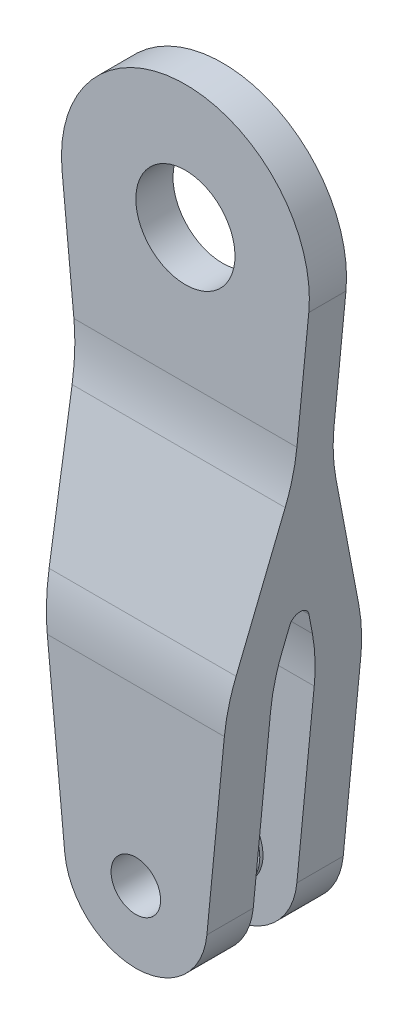
ISO-10303-21;
HEADER;
FILE_DESCRIPTION(('STEP AP214'),'2;1');
FILE_NAME('part.step','',(''),(''),'','','');
FILE_SCHEMA(('AUTOMOTIVE_DESIGN { 1 0 10303 214 1 1 1 1 }'));
ENDSEC;
DATA;
#1=APPLICATION_CONTEXT('core data for automotive mechanical design processes');
#2=APPLICATION_PROTOCOL_DEFINITION('international standard','automotive_design',2000,#1);
#3=PRODUCT_CONTEXT('',#1,'mechanical');
#4=PRODUCT('Part','Part','',(#3));
#5=PRODUCT_RELATED_PRODUCT_CATEGORY('part','',(#4));
#6=PRODUCT_DEFINITION_FORMATION('','',#4);
#7=PRODUCT_DEFINITION_CONTEXT('part definition',#1,'design');
#8=PRODUCT_DEFINITION('design','',#6,#7);
#9=PRODUCT_DEFINITION_SHAPE('','',#8);
#10=(LENGTH_UNIT() NAMED_UNIT(*) SI_UNIT(.MILLI.,.METRE.));
#11=(NAMED_UNIT(*) PLANE_ANGLE_UNIT() SI_UNIT($,.RADIAN.));
#12=(NAMED_UNIT(*) SI_UNIT($,.STERADIAN.) SOLID_ANGLE_UNIT());
#13=UNCERTAINTY_MEASURE_WITH_UNIT(LENGTH_MEASURE(1.E-05),#10,'distance_accuracy_value','');
#14=(GEOMETRIC_REPRESENTATION_CONTEXT(3) GLOBAL_UNCERTAINTY_ASSIGNED_CONTEXT((#13)) GLOBAL_UNIT_ASSIGNED_CONTEXT((#10,
#11,#12)) REPRESENTATION_CONTEXT('',''));
#15=CARTESIAN_POINT('',(0.,0.,0.));
#16=DIRECTION('',(0.,0.,1.));
#17=DIRECTION('',(1.,0.,0.));
#18=AXIS2_PLACEMENT_3D('',#15,#16,#17);
#19=CARTESIAN_POINT('',(-15.875,0.,-2.794));
#20=DIRECTION('',(0.,0.,1.));
#21=DIRECTION('',(0.,-1.,0.));
#22=AXIS2_PLACEMENT_3D('',#19,#20,#21);
#23=PLANE('',#22);
#24=DIRECTION('',(0.0963636363636364,0.995346195846841,0.));
#25=VECTOR('',#24,1.);
#26=CARTESIAN_POINT('',(9.10144561482351,-0.88114909090909,-2.794));
#27=LINE('',#26,#25);
#28=CARTESIAN_POINT('',(9.10144561482351,-0.881149090909097,-2.794));
#29=VERTEX_POINT('',#28);
#30=CARTESIAN_POINT('',(11.3220897112988,22.0560265612801,-2.794));
#31=VERTEX_POINT('',#30);
#32=EDGE_CURVE('E513',#29,#31,#27,.T.);
#33=ORIENTED_EDGE('',*,*,#32,.T.);
#34=DIRECTION('',(1.,0.,0.));
#35=VECTOR('',#34,1.);
#36=CARTESIAN_POINT('',(-11.6458337933107,22.0560265612801,-2.794));
#37=LINE('',#36,#35);
#38=CARTESIAN_POINT('',(-11.3220897112988,22.0560265612801,-2.794));
#39=VERTEX_POINT('',#38);
#40=EDGE_CURVE('E376',#31,#39,#37,.F.);
#41=ORIENTED_EDGE('',*,*,#40,.T.);
#42=DIRECTION('',(0.0963636363636363,-0.995346195846841,0.));
#43=VECTOR('',#42,1.);
#44=CARTESIAN_POINT('',(-15.8011208590686,68.3202272727273,-2.794));
#45=LINE('',#44,#43);
#46=CARTESIAN_POINT('',(-9.10144561482351,-0.881149090909091,-2.794));
#47=VERTEX_POINT('',#46);
#48=EDGE_CURVE('E508',#39,#47,#45,.T.);
#49=ORIENTED_EDGE('',*,*,#48,.T.);
#50=CARTESIAN_POINT('',(0.,0.,-2.794));
#51=DIRECTION('',(0.,0.,1.));
#52=DIRECTION('',(0.,-1.,0.));
#53=AXIS2_PLACEMENT_3D('',#50,#51,#52);
#54=CIRCLE('',#53,9.144);
#55=EDGE_CURVE('E467',#47,#29,#54,.T.);
#56=ORIENTED_EDGE('',*,*,#55,.T.);
#57=EDGE_LOOP('',(#33,#41,#49,#56));
#58=FACE_BOUND('',#57,.T.);
#59=CARTESIAN_POINT('',(0.,0.,-2.794));
#60=DIRECTION('',(0.,0.,1.));
#61=DIRECTION('',(0.,-1.,0.));
#62=AXIS2_PLACEMENT_3D('',#59,#60,#61);
#63=CIRCLE('',#62,4.7625);
#64=CARTESIAN_POINT('',(0.,-4.7625,-2.794));
#65=VERTEX_POINT('',#64);
#66=EDGE_CURVE('E367',#65,#65,#63,.F.);
#67=ORIENTED_EDGE('',*,*,#66,.T.);
#68=EDGE_LOOP('',(#67));
#69=FACE_BOUND('',#68,.T.);
#70=ADVANCED_FACE('F151',(#58,#69),#23,.T.);
#71=CARTESIAN_POINT('',(0.,69.85,8.73125));
#72=DIRECTION('',(0.,0.,1.));
#73=DIRECTION('',(1.,0.,0.));
#74=AXIS2_PLACEMENT_3D('',#71,#72,#73);
#75=PLANE('',#74);
#76=DIRECTION('',(0.0963636363636364,0.99534619584684,0.));
#77=VECTOR('',#76,1.);
#78=CARTESIAN_POINT('',(9.10144561482351,-0.881149090909091,8.73125));
#79=LINE('',#78,#77);
#80=CARTESIAN_POINT('',(9.10144561482351,-0.881149090909097,8.73125));
#81=VERTEX_POINT('',#80);
#82=CARTESIAN_POINT('',(11.3387131575022,22.2277312059451,8.73125));
#83=VERTEX_POINT('',#82);
#84=EDGE_CURVE('E318',#81,#83,#79,.T.);
#85=ORIENTED_EDGE('',*,*,#84,.T.);
#86=DIRECTION('',(1.,0.,0.));
#87=VECTOR('',#86,1.);
#88=CARTESIAN_POINT('',(0.,22.2277312059451,8.73125));
#89=LINE('',#88,#87);
#90=CARTESIAN_POINT('',(-11.3387131575022,22.2277312059451,8.73125));
#91=VERTEX_POINT('',#90);
#92=EDGE_CURVE('E419',#83,#91,#89,.F.);
#93=ORIENTED_EDGE('',*,*,#92,.T.);
#94=DIRECTION('',(0.0963636363636363,-0.99534619584684,0.));
#95=VECTOR('',#94,1.);
#96=CARTESIAN_POINT('',(-15.8011208590686,68.3202272727273,8.73125));
#97=LINE('',#96,#95);
#98=CARTESIAN_POINT('',(-9.10144561482351,-0.881149090909091,8.73125));
#99=VERTEX_POINT('',#98);
#100=EDGE_CURVE('E478',#91,#99,#97,.T.);
#101=ORIENTED_EDGE('',*,*,#100,.T.);
#102=CARTESIAN_POINT('',(0.,0.,8.73125));
#103=DIRECTION('',(0.,0.,1.));
#104=DIRECTION('',(1.,0.,0.));
#105=AXIS2_PLACEMENT_3D('',#102,#103,#104);
#106=CIRCLE('',#105,9.144);
#107=EDGE_CURVE('E325',#99,#81,#106,.T.);
#108=ORIENTED_EDGE('',*,*,#107,.T.);
#109=EDGE_LOOP('',(#85,#93,#101,#108));
#110=FACE_BOUND('',#109,.T.);
#111=CARTESIAN_POINT('',(0.,0.,8.73125));
#112=DIRECTION('',(0.,0.,1.));
#113=DIRECTION('',(1.,0.,0.));
#114=AXIS2_PLACEMENT_3D('',#111,#112,#113);
#115=CIRCLE('',#114,3.175);
#116=CARTESIAN_POINT('',(3.175,0.,8.73125));
#117=VERTEX_POINT('',#116);
#118=EDGE_CURVE('E479',#117,#117,#115,.T.);
#119=ORIENTED_EDGE('',*,*,#118,.F.);
#120=EDGE_LOOP('',(#119));
#121=FACE_BOUND('',#120,.T.);
#122=ADVANCED_FACE('F571',(#110,#121),#75,.T.);
#123=CARTESIAN_POINT('',(0.,69.85,8.73125));
#124=DIRECTION('',(0.,0.,-1.));
#125=DIRECTION('',(-1.,0.,0.));
#126=AXIS2_PLACEMENT_3D('',#123,#124,#125);
#127=CYLINDRICAL_SURFACE('',#126,15.875);
#128=DIRECTION('',(0.,0.,-1.));
#129=VECTOR('',#128,1.);
#130=CARTESIAN_POINT('',(15.8011208590686,68.3202272727273,8.73125));
#131=LINE('',#130,#129);
#132=CARTESIAN_POINT('',(15.8011208590686,68.3202272727273,2.38125));
#133=VERTEX_POINT('',#132);
#134=CARTESIAN_POINT('',(15.8011208590686,68.3202272727273,-2.38125));
#135=VERTEX_POINT('',#134);
#136=EDGE_CURVE('E305',#133,#135,#131,.T.);
#137=ORIENTED_EDGE('',*,*,#136,.T.);
#138=CARTESIAN_POINT('',(0.,69.85,-2.38125));
#139=DIRECTION('',(0.,0.,1.));
#140=DIRECTION('',(0.,-1.,0.));
#141=AXIS2_PLACEMENT_3D('',#138,#139,#140);
#142=CIRCLE('',#141,15.875);
#143=CARTESIAN_POINT('',(-15.8011208590686,68.3202272727273,-2.38125));
#144=VERTEX_POINT('',#143);
#145=EDGE_CURVE('E531',#135,#144,#142,.T.);
#146=ORIENTED_EDGE('',*,*,#145,.T.);
#147=DIRECTION('',(0.,0.,-1.));
#148=VECTOR('',#147,1.);
#149=CARTESIAN_POINT('',(-15.8011208590686,68.3202272727273,8.73125));
#150=LINE('',#149,#148);
#151=CARTESIAN_POINT('',(-15.8011208590686,68.3202272727273,2.38125));
#152=VERTEX_POINT('',#151);
#153=EDGE_CURVE('E307',#152,#144,#150,.T.);
#154=ORIENTED_EDGE('',*,*,#153,.F.);
#155=CARTESIAN_POINT('',(0.,69.85,2.38125));
#156=DIRECTION('',(0.,0.,1.));
#157=DIRECTION('',(0.,-1.,0.));
#158=AXIS2_PLACEMENT_3D('',#155,#156,#157);
#159=CIRCLE('',#158,15.875);
#160=EDGE_CURVE('E292',#133,#152,#159,.T.);
#161=ORIENTED_EDGE('',*,*,#160,.F.);
#162=EDGE_LOOP('',(#137,#146,#154,#161));
#163=FACE_BOUND('',#162,.T.);
#164=ADVANCED_FACE('F303',(#163),#127,.T.);
#165=CARTESIAN_POINT('',(-15.8011208590686,68.3202272727273,8.73125));
#166=DIRECTION('',(0.99534619584684,0.0963636363636363,0.));
#167=DIRECTION('',(-0.0963636363636363,0.995346195846841,0.));
#168=AXIS2_PLACEMENT_3D('',#165,#166,#167);
#169=PLANE('',#168);
#170=DIRECTION('',(0.0931090884061508,-0.961729760737852,-0.257694712726685));
#171=VECTOR('',#170,1.);
#172=CARTESIAN_POINT('',(-15.9452767563555,69.8092228045265,3.12215726609206));
#173=LINE('',#172,#171);
#174=CARTESIAN_POINT('',(-13.6440977573359,46.0401969658431,-3.24673401225768));
#175=VERTEX_POINT('',#174);
#176=CARTESIAN_POINT('',(-11.9751700094376,28.8017349515492,-7.86576598774233));
#177=VERTEX_POINT('',#176);
#178=EDGE_CURVE('E490',#175,#177,#173,.T.);
#179=ORIENTED_EDGE('',*,*,#178,.T.);
#180=CARTESIAN_POINT('',(-11.3387131575022,22.2277312059451,16.66875));
#181=DIRECTION('',(0.99534619584684,0.0963636363636363,0.));
#182=DIRECTION('',(0.0963636363636363,-0.995346195846841,0.));
#183=AXIS2_PLACEMENT_3D('',#180,#181,#182);
#184=ELLIPSE('',#183,25.5187593080513,25.4);
#185=CARTESIAN_POINT('',(-11.3387131575022,22.2277312059451,-8.73125));
#186=VERTEX_POINT('',#185);
#187=EDGE_CURVE('E409',#177,#186,#184,.F.);
#188=ORIENTED_EDGE('',*,*,#187,.T.);
#189=DIRECTION('',(0.0963636363636363,-0.99534619584684,0.));
#190=VECTOR('',#189,1.);
#191=CARTESIAN_POINT('',(-15.8011208590686,68.3202272727273,-8.73125));
#192=LINE('',#191,#190);
#193=CARTESIAN_POINT('',(-9.10144561482351,-0.881149090909091,-8.73125));
#194=VERTEX_POINT('',#193);
#195=EDGE_CURVE('E473',#186,#194,#192,.T.);
#196=ORIENTED_EDGE('',*,*,#195,.T.);
#197=DIRECTION('',(0.,0.,-1.));
#198=VECTOR('',#197,1.);
#199=CARTESIAN_POINT('',(-9.10144561482351,-0.881149090909091,8.73125));
#200=LINE('',#199,#198);
#201=EDGE_CURVE('E333',#47,#194,#200,.T.);
#202=ORIENTED_EDGE('',*,*,#201,.F.);
#203=ORIENTED_EDGE('',*,*,#48,.F.);
#204=CARTESIAN_POINT('',(-11.3220897112988,22.0560265612801,22.606));
#205=DIRECTION('',(0.99534619584684,0.0963636363636363,0.));
#206=DIRECTION('',(-0.0963636363636363,0.995346195846841,0.));
#207=AXIS2_PLACEMENT_3D('',#204,#205,#206);
#208=ELLIPSE('',#207,25.5187593080513,25.4);
#209=CARTESIAN_POINT('',(-11.9585465632342,28.6300303068842,-1.92851598774233));
#210=VERTEX_POINT('',#209);
#211=EDGE_CURVE('E427',#39,#210,#208,.T.);
#212=ORIENTED_EDGE('',*,*,#211,.T.);
#213=DIRECTION('',(0.0931090884061508,-0.961729760737852,-0.257694712726685));
#214=VECTOR('',#213,1.);
#215=CARTESIAN_POINT('',(-15.8017161375775,68.3263759427206,8.70808776784679));
#216=LINE('',#215,#214);
#217=CARTESIAN_POINT('',(-12.2121142208657,31.2491469460791,-1.22672579938712));
#218=VERTEX_POINT('',#217);
#219=EDGE_CURVE('E501',#218,#210,#216,.T.);
#220=ORIENTED_EDGE('',*,*,#219,.F.);
#221=CARTESIAN_POINT('',(-12.180291378269,30.9204467587989,0.));
#222=DIRECTION('',(0.99534619584684,0.0963636363636363,0.));
#223=DIRECTION('',(-0.0963636363636363,0.995346195846841,0.));
#224=AXIS2_PLACEMENT_3D('',#221,#222,#223);
#225=ELLIPSE('',#224,1.27593796540256,1.27);
#226=CARTESIAN_POINT('',(-12.2121142208657,31.2491469460791,1.22672579938712));
#227=VERTEX_POINT('',#226);
#228=EDGE_CURVE('E12',#218,#227,#225,.T.);
#229=ORIENTED_EDGE('',*,*,#228,.T.);
#230=DIRECTION('',(-0.0931090884061508,0.961729760737852,-0.257694712726685));
#231=VECTOR('',#230,1.);
#232=CARTESIAN_POINT('',(-15.382725805761,63.9985978657653,-7.54846312710552));
#233=LINE('',#232,#231);
#234=CARTESIAN_POINT('',(-11.9585465632342,28.6300303068842,1.92851598774233));
#235=VERTEX_POINT('',#234);
#236=EDGE_CURVE('E497',#235,#227,#233,.T.);
#237=ORIENTED_EDGE('',*,*,#236,.F.);
#238=CARTESIAN_POINT('',(-11.3220897112988,22.0560265612801,-22.606));
#239=DIRECTION('',(0.99534619584684,0.0963636363636363,0.));
#240=DIRECTION('',(-0.0963636363636363,0.995346195846841,0.));
#241=AXIS2_PLACEMENT_3D('',#238,#239,#240);
#242=ELLIPSE('',#241,25.5187593080513,25.4);
#243=CARTESIAN_POINT('',(-11.3220897112988,22.0560265612801,2.794));
#244=VERTEX_POINT('',#243);
#245=EDGE_CURVE('E435',#235,#244,#242,.T.);
#246=ORIENTED_EDGE('',*,*,#245,.T.);
#247=DIRECTION('',(-0.0963636363636363,0.995346195846841,0.));
#248=VECTOR('',#247,1.);
#249=CARTESIAN_POINT('',(-15.8011208590686,68.3202272727273,2.794));
#250=LINE('',#249,#248);
#251=CARTESIAN_POINT('',(-9.10144561482351,-0.881149090909091,2.794));
#252=VERTEX_POINT('',#251);
#253=EDGE_CURVE('E517',#252,#244,#250,.T.);
#254=ORIENTED_EDGE('',*,*,#253,.F.);
#255=EDGE_CURVE('E334',#99,#252,#200,.T.);
#256=ORIENTED_EDGE('',*,*,#255,.F.);
#257=ORIENTED_EDGE('',*,*,#100,.F.);
#258=CARTESIAN_POINT('',(-11.3387131575022,22.2277312059451,-16.66875));
#259=DIRECTION('',(0.99534619584684,0.0963636363636363,0.));
#260=DIRECTION('',(0.0963636363636363,-0.995346195846841,0.));
#261=AXIS2_PLACEMENT_3D('',#258,#259,#260);
#262=ELLIPSE('',#261,25.5187593080513,25.4);
#263=CARTESIAN_POINT('',(-11.9751700094376,28.8017349515492,7.86576598774233));
#264=VERTEX_POINT('',#263);
#265=EDGE_CURVE('E406',#91,#264,#262,.F.);
#266=ORIENTED_EDGE('',*,*,#265,.T.);
#267=DIRECTION('',(0.0931090884061508,-0.961729760737852,0.257694712726686));
#268=VECTOR('',#267,1.);
#269=CARTESIAN_POINT('',(-15.5262864245389,65.4814447275712,-1.96253262535078));
#270=LINE('',#269,#268);
#271=CARTESIAN_POINT('',(-13.6440977573359,46.0401969658431,3.24673401225766));
#272=VERTEX_POINT('',#271);
#273=EDGE_CURVE('E504',#272,#264,#270,.T.);
#274=ORIENTED_EDGE('',*,*,#273,.F.);
#275=CARTESIAN_POINT('',(-14.2805546092713,52.6142007114472,27.78125));
#276=DIRECTION('',(0.99534619584684,0.0963636363636363,0.));
#277=DIRECTION('',(-0.0963636363636363,0.995346195846841,0.));
#278=AXIS2_PLACEMENT_3D('',#275,#276,#277);
#279=ELLIPSE('',#278,25.5187593080513,25.4);
#280=CARTESIAN_POINT('',(-14.2805546092713,52.6142007114472,2.38125));
#281=VERTEX_POINT('',#280);
#282=EDGE_CURVE('E447',#272,#281,#279,.T.);
#283=ORIENTED_EDGE('',*,*,#282,.T.);
#284=DIRECTION('',(0.0963636363636363,-0.995346195846841,0.));
#285=VECTOR('',#284,1.);
#286=CARTESIAN_POINT('',(-15.8011208590686,68.3202272727273,2.38125));
#287=LINE('',#286,#285);
#288=EDGE_CURVE('E309',#152,#281,#287,.T.);
#289=ORIENTED_EDGE('',*,*,#288,.F.);
#290=ORIENTED_EDGE('',*,*,#153,.T.);
#291=DIRECTION('',(0.0963636363636363,-0.995346195846841,0.));
#292=VECTOR('',#291,1.);
#293=CARTESIAN_POINT('',(-15.8011208590686,68.3202272727273,-2.38125));
#294=LINE('',#293,#292);
#295=CARTESIAN_POINT('',(-14.2805546092713,52.6142007114471,-2.38125));
#296=VERTEX_POINT('',#295);
#297=EDGE_CURVE('E527',#144,#296,#294,.T.);
#298=ORIENTED_EDGE('',*,*,#297,.T.);
#299=CARTESIAN_POINT('',(-14.2805546092713,52.6142007114471,-27.78125));
#300=DIRECTION('',(0.99534619584684,0.0963636363636363,0.));
#301=DIRECTION('',(-0.0963636363636363,0.995346195846841,0.));
#302=AXIS2_PLACEMENT_3D('',#299,#300,#301);
#303=ELLIPSE('',#302,25.5187593080513,25.4);
#304=EDGE_CURVE('E441',#296,#175,#303,.T.);
#305=ORIENTED_EDGE('',*,*,#304,.T.);
#306=EDGE_LOOP('',(#179,#188,#196,#202,#203,#212,#220,#229,#237,#246,#254,#256,#257,#266,#274,
#283,#289,#290,#298,#305));
#307=FACE_BOUND('',#306,.T.);
#308=ADVANCED_FACE('F617',(#307),#169,.F.);
#309=CARTESIAN_POINT('',(0.,0.,8.73125));
#310=DIRECTION('',(0.,0.,-1.));
#311=DIRECTION('',(-1.,0.,0.));
#312=AXIS2_PLACEMENT_3D('',#309,#310,#311);
#313=CYLINDRICAL_SURFACE('',#312,9.144);
#314=DIRECTION('',(0.,0.,-1.));
#315=VECTOR('',#314,1.);
#316=CARTESIAN_POINT('',(9.10144561482351,-0.881149090909097,8.73125));
#317=LINE('',#316,#315);
#318=CARTESIAN_POINT('',(9.10144561482351,-0.881149090909097,-8.73125));
#319=VERTEX_POINT('',#318);
#320=EDGE_CURVE('E317',#29,#319,#317,.T.);
#321=ORIENTED_EDGE('',*,*,#320,.F.);
#322=ORIENTED_EDGE('',*,*,#55,.F.);
#323=ORIENTED_EDGE('',*,*,#201,.T.);
#324=CARTESIAN_POINT('',(0.,0.,-8.73125));
#325=DIRECTION('',(0.,0.,1.));
#326=DIRECTION('',(1.,0.,0.));
#327=AXIS2_PLACEMENT_3D('',#324,#325,#326);
#328=CIRCLE('',#327,9.144);
#329=EDGE_CURVE('E465',#194,#319,#328,.T.);
#330=ORIENTED_EDGE('',*,*,#329,.T.);
#331=EDGE_LOOP('',(#321,#322,#323,#330));
#332=FACE_BOUND('',#331,.T.);
#333=ADVANCED_FACE('F464',(#332),#313,.T.);
#334=CARTESIAN_POINT('',(0.,0.,2.794));
#335=DIRECTION('',(0.,0.,-1.));
#336=DIRECTION('',(-1.,0.,0.));
#337=AXIS2_PLACEMENT_3D('',#334,#335,#336);
#338=CIRCLE('',#337,9.144);
#339=CARTESIAN_POINT('',(9.10144561482351,-0.881149090909097,2.794));
#340=VERTEX_POINT('',#339);
#341=EDGE_CURVE('E521',#340,#252,#338,.T.);
#342=ORIENTED_EDGE('',*,*,#341,.F.);
#343=EDGE_CURVE('E322',#81,#340,#317,.T.);
#344=ORIENTED_EDGE('',*,*,#343,.F.);
#345=ORIENTED_EDGE('',*,*,#107,.F.);
#346=ORIENTED_EDGE('',*,*,#255,.T.);
#347=EDGE_LOOP('',(#342,#344,#345,#346));
#348=FACE_BOUND('',#347,.T.);
#349=ADVANCED_FACE('F614',(#348),#313,.T.);
#350=CARTESIAN_POINT('',(9.10144561482351,-0.881149090909091,8.73125));
#351=DIRECTION('',(-0.99534619584684,0.0963636363636364,0.));
#352=DIRECTION('',(-0.0963636363636364,-0.995346195846841,0.));
#353=AXIS2_PLACEMENT_3D('',#350,#351,#352);
#354=PLANE('',#353);
#355=DIRECTION('',(0.0963636363636364,0.99534619584684,0.));
#356=VECTOR('',#355,1.);
#357=CARTESIAN_POINT('',(9.10144561482351,-0.881149090909091,-8.73125));
#358=LINE('',#357,#356);
#359=CARTESIAN_POINT('',(11.3387131575022,22.2277312059451,-8.73125));
#360=VERTEX_POINT('',#359);
#361=EDGE_CURVE('E328',#319,#360,#358,.T.);
#362=ORIENTED_EDGE('',*,*,#361,.T.);
#363=CARTESIAN_POINT('',(11.3387131575022,22.2277312059451,16.66875));
#364=DIRECTION('',(-0.99534619584684,0.0963636363636364,0.));
#365=DIRECTION('',(0.0963636363636364,0.995346195846841,0.));
#366=AXIS2_PLACEMENT_3D('',#363,#364,#365);
#367=ELLIPSE('',#366,25.5187593080513,25.4);
#368=CARTESIAN_POINT('',(11.9751700094376,28.8017349515492,-7.86576598774233));
#369=VERTEX_POINT('',#368);
#370=EDGE_CURVE('E403',#360,#369,#367,.F.);
#371=ORIENTED_EDGE('',*,*,#370,.T.);
#372=DIRECTION('',(0.0931090884061509,0.961729760737852,0.257694712726685));
#373=VECTOR('',#372,1.);
#374=CARTESIAN_POINT('',(9.69050393147708,5.20327213620776,-14.188955041729));
#375=LINE('',#374,#373);
#376=CARTESIAN_POINT('',(13.6440977573359,46.0401969658431,-3.24673401225767));
#377=VERTEX_POINT('',#376);
#378=EDGE_CURVE('E358',#369,#377,#375,.T.);
#379=ORIENTED_EDGE('',*,*,#378,.T.);
#380=CARTESIAN_POINT('',(14.2805546092713,52.6142007114471,-27.78125));
#381=DIRECTION('',(-0.99534619584684,0.0963636363636364,0.));
#382=DIRECTION('',(-0.0963636363636364,-0.995346195846841,0.));
#383=AXIS2_PLACEMENT_3D('',#380,#381,#382);
#384=ELLIPSE('',#383,25.5187593080513,25.4);
#385=CARTESIAN_POINT('',(14.2805546092713,52.6142007114472,-2.38125));
#386=VERTEX_POINT('',#385);
#387=EDGE_CURVE('E438',#377,#386,#384,.T.);
#388=ORIENTED_EDGE('',*,*,#387,.T.);
#389=DIRECTION('',(0.0963636363636364,0.995346195846841,0.));
#390=VECTOR('',#389,1.);
#391=CARTESIAN_POINT('',(9.10144561482351,-0.881149090909091,-2.38125));
#392=LINE('',#391,#390);
#393=EDGE_CURVE('E314',#386,#135,#392,.T.);
#394=ORIENTED_EDGE('',*,*,#393,.T.);
#395=ORIENTED_EDGE('',*,*,#136,.F.);
#396=DIRECTION('',(0.0963636363636364,0.995346195846841,0.));
#397=VECTOR('',#396,1.);
#398=CARTESIAN_POINT('',(9.10144561482351,-0.881149090909091,2.38125));
#399=LINE('',#398,#397);
#400=CARTESIAN_POINT('',(14.2805546092713,52.6142007114472,2.38125));
#401=VERTEX_POINT('',#400);
#402=EDGE_CURVE('E288',#401,#133,#399,.T.);
#403=ORIENTED_EDGE('',*,*,#402,.F.);
#404=CARTESIAN_POINT('',(14.2805546092713,52.6142007114472,27.78125));
#405=DIRECTION('',(-0.99534619584684,0.0963636363636364,0.));
#406=DIRECTION('',(-0.0963636363636364,-0.995346195846841,0.));
#407=AXIS2_PLACEMENT_3D('',#404,#405,#406);
#408=ELLIPSE('',#407,25.5187593080513,25.4);
#409=CARTESIAN_POINT('',(13.6440977573359,46.0401969658431,3.24673401225766));
#410=VERTEX_POINT('',#409);
#411=EDGE_CURVE('E444',#401,#410,#408,.T.);
#412=ORIENTED_EDGE('',*,*,#411,.T.);
#413=DIRECTION('',(0.0931090884061509,0.961729760737852,-0.257694712726686));
#414=VECTOR('',#413,1.);
#415=CARTESIAN_POINT('',(9.27151359966051,0.875494059252503,15.3485796824703));
#416=LINE('',#415,#414);
#417=CARTESIAN_POINT('',(11.9751700094376,28.8017349515492,7.86576598774233));
#418=VERTEX_POINT('',#417);
#419=EDGE_CURVE('E340',#418,#410,#416,.T.);
#420=ORIENTED_EDGE('',*,*,#419,.F.);
#421=CARTESIAN_POINT('',(11.3387131575022,22.2277312059451,-16.66875));
#422=DIRECTION('',(-0.99534619584684,0.0963636363636364,0.));
#423=DIRECTION('',(0.0963636363636364,0.995346195846841,0.));
#424=AXIS2_PLACEMENT_3D('',#421,#422,#423);
#425=ELLIPSE('',#424,25.5187593080513,25.4);
#426=EDGE_CURVE('E400',#418,#83,#425,.F.);
#427=ORIENTED_EDGE('',*,*,#426,.T.);
#428=ORIENTED_EDGE('',*,*,#84,.F.);
#429=ORIENTED_EDGE('',*,*,#343,.T.);
#430=DIRECTION('',(-0.0963636363636364,-0.995346195846841,0.));
#431=VECTOR('',#430,1.);
#432=CARTESIAN_POINT('',(9.10144561482351,-0.881149090909091,2.794));
#433=LINE('',#432,#431);
#434=CARTESIAN_POINT('',(11.3220897112988,22.0560265612801,2.794));
#435=VERTEX_POINT('',#434);
#436=EDGE_CURVE('E524',#435,#340,#433,.T.);
#437=ORIENTED_EDGE('',*,*,#436,.F.);
#438=CARTESIAN_POINT('',(11.3220897112988,22.0560265612801,-22.606));
#439=DIRECTION('',(-0.99534619584684,0.0963636363636364,0.));
#440=DIRECTION('',(-0.0963636363636364,-0.995346195846841,0.));
#441=AXIS2_PLACEMENT_3D('',#438,#439,#440);
#442=ELLIPSE('',#441,25.5187593080513,25.4);
#443=CARTESIAN_POINT('',(11.9585465632342,28.6300303068842,1.92851598774233));
#444=VERTEX_POINT('',#443);
#445=EDGE_CURVE('E431',#435,#444,#442,.T.);
#446=ORIENTED_EDGE('',*,*,#445,.T.);
#447=DIRECTION('',(-0.0931090884061509,-0.961729760737852,0.257694712726685));
#448=VECTOR('',#447,1.);
#449=CARTESIAN_POINT('',(9.12795298088258,-0.607352802553418,9.76264918071551));
#450=LINE('',#449,#448);
#451=CARTESIAN_POINT('',(12.2121142208657,31.2491469460792,1.22672579938712));
#452=VERTEX_POINT('',#451);
#453=EDGE_CURVE('E355',#452,#444,#450,.T.);
#454=ORIENTED_EDGE('',*,*,#453,.F.);
#455=CARTESIAN_POINT('',(12.180291378269,30.9204467587989,0.));
#456=DIRECTION('',(-0.99534619584684,0.0963636363636364,0.));
#457=DIRECTION('',(-0.0963636363636364,-0.995346195846841,0.));
#458=AXIS2_PLACEMENT_3D('',#455,#456,#457);
#459=ELLIPSE('',#458,1.27593796540256,1.27);
#460=CARTESIAN_POINT('',(12.2121142208657,31.2491469460792,-1.22672579938712));
#461=VERTEX_POINT('',#460);
#462=EDGE_CURVE('E160',#452,#461,#459,.T.);
#463=ORIENTED_EDGE('',*,*,#462,.T.);
#464=DIRECTION('',(0.0931090884061509,0.961729760737852,0.257694712726685));
#465=VECTOR('',#464,1.);
#466=CARTESIAN_POINT('',(9.54694331269916,3.72042527440184,-8.60302453997423));
#467=LINE('',#466,#465);
#468=CARTESIAN_POINT('',(11.9585465632342,28.6300303068842,-1.92851598774233));
#469=VERTEX_POINT('',#468);
#470=EDGE_CURVE('E352',#469,#461,#467,.T.);
#471=ORIENTED_EDGE('',*,*,#470,.F.);
#472=CARTESIAN_POINT('',(11.3220897112988,22.0560265612801,22.606));
#473=DIRECTION('',(-0.99534619584684,0.0963636363636364,0.));
#474=DIRECTION('',(-0.0963636363636364,-0.995346195846841,0.));
#475=AXIS2_PLACEMENT_3D('',#472,#473,#474);
#476=ELLIPSE('',#475,25.5187593080513,25.4);
#477=EDGE_CURVE('E424',#469,#31,#476,.T.);
#478=ORIENTED_EDGE('',*,*,#477,.T.);
#479=ORIENTED_EDGE('',*,*,#32,.F.);
#480=ORIENTED_EDGE('',*,*,#320,.T.);
#481=EDGE_LOOP('',(#362,#371,#379,#388,#394,#395,#403,#412,#420,#427,#428,#429,#437,#446,#454,
#463,#471,#478,#479,#480));
#482=FACE_BOUND('',#481,.T.);
#483=ADVANCED_FACE('F312',(#482),#354,.F.);
#484=CARTESIAN_POINT('',(0.,0.,8.73125));
#485=DIRECTION('',(0.,0.,-1.));
#486=DIRECTION('',(-1.,0.,0.));
#487=AXIS2_PLACEMENT_3D('',#484,#485,#486);
#488=CYLINDRICAL_SURFACE('',#487,3.175);
#489=CARTESIAN_POINT('',(0.,0.,-8.73125));
#490=DIRECTION('',(0.,0.,1.));
#491=DIRECTION('',(1.,0.,0.));
#492=AXIS2_PLACEMENT_3D('',#489,#490,#491);
#493=CIRCLE('',#492,3.175);
#494=CARTESIAN_POINT('',(3.175,0.,-8.73125));
#495=VERTEX_POINT('',#494);
#496=EDGE_CURVE('E486',#495,#495,#493,.T.);
#497=ORIENTED_EDGE('',*,*,#496,.F.);
#498=EDGE_LOOP('',(#497));
#499=FACE_BOUND('',#498,.T.);
#500=CARTESIAN_POINT('',(0.,0.,-2.38125));
#501=DIRECTION('',(0.,0.,1.));
#502=DIRECTION('',(1.,0.,0.));
#503=AXIS2_PLACEMENT_3D('',#500,#501,#502);
#504=CIRCLE('',#503,3.175);
#505=CARTESIAN_POINT('',(3.175,0.,-2.38125));
#506=VERTEX_POINT('',#505);
#507=EDGE_CURVE('E547',#506,#506,#504,.T.);
#508=ORIENTED_EDGE('',*,*,#507,.T.);
#509=EDGE_LOOP('',(#508));
#510=FACE_BOUND('',#509,.T.);
#511=ADVANCED_FACE('F552',(#499,#510),#488,.F.);
#512=ORIENTED_EDGE('',*,*,#118,.T.);
#513=EDGE_LOOP('',(#512));
#514=FACE_BOUND('',#513,.T.);
#515=CARTESIAN_POINT('',(0.,0.,2.38125));
#516=DIRECTION('',(0.,0.,1.));
#517=DIRECTION('',(1.,0.,0.));
#518=AXIS2_PLACEMENT_3D('',#515,#516,#517);
#519=CIRCLE('',#518,3.175);
#520=CARTESIAN_POINT('',(3.175,0.,2.38125));
#521=VERTEX_POINT('',#520);
#522=EDGE_CURVE('E371',#521,#521,#519,.T.);
#523=ORIENTED_EDGE('',*,*,#522,.F.);
#524=EDGE_LOOP('',(#523));
#525=FACE_BOUND('',#524,.T.);
#526=ADVANCED_FACE('F606',(#514,#525),#488,.F.);
#527=CARTESIAN_POINT('',(0.,69.85,-8.73125));
#528=DIRECTION('',(0.,0.,1.));
#529=DIRECTION('',(1.,0.,0.));
#530=AXIS2_PLACEMENT_3D('',#527,#528,#529);
#531=PLANE('',#530);
#532=ORIENTED_EDGE('',*,*,#496,.T.);
#533=EDGE_LOOP('',(#532));
#534=FACE_BOUND('',#533,.T.);
#535=ORIENTED_EDGE('',*,*,#195,.F.);
#536=DIRECTION('',(1.,0.,0.));
#537=VECTOR('',#536,1.);
#538=CARTESIAN_POINT('',(0.,22.2277312059451,-8.73125));
#539=LINE('',#538,#537);
#540=EDGE_CURVE('E396',#186,#360,#539,.T.);
#541=ORIENTED_EDGE('',*,*,#540,.T.);
#542=ORIENTED_EDGE('',*,*,#361,.F.);
#543=ORIENTED_EDGE('',*,*,#329,.F.);
#544=EDGE_LOOP('',(#535,#541,#542,#543));
#545=FACE_BOUND('',#544,.T.);
#546=ADVANCED_FACE('F472',(#534,#545),#531,.F.);
#547=CARTESIAN_POINT('',(-15.875,3.89579190215632,14.5392933145627));
#548=DIRECTION('',(0.,0.258819045102522,0.965925826289068));
#549=DIRECTION('',(0.,-0.965925826289068,0.258819045102522));
#550=AXIS2_PLACEMENT_3D('',#547,#548,#549);
#551=PLANE('',#550);
#552=ORIENTED_EDGE('',*,*,#273,.T.);
#553=DIRECTION('',(1.,0.,0.));
#554=VECTOR('',#553,1.);
#555=CARTESIAN_POINT('',(-15.875,28.8017349515492,7.86576598774233));
#556=LINE('',#555,#554);
#557=EDGE_CURVE('E415',#264,#418,#556,.T.);
#558=ORIENTED_EDGE('',*,*,#557,.T.);
#559=ORIENTED_EDGE('',*,*,#419,.T.);
#560=DIRECTION('',(1.,0.,0.));
#561=VECTOR('',#560,1.);
#562=CARTESIAN_POINT('',(-13.9568105272594,46.0401969658431,3.24673401225766));
#563=LINE('',#562,#561);
#564=EDGE_CURVE('E412',#410,#272,#563,.F.);
#565=ORIENTED_EDGE('',*,*,#564,.T.);
#566=EDGE_LOOP('',(#552,#558,#559,#565));
#567=FACE_BOUND('',#566,.T.);
#568=ADVANCED_FACE('F595',(#567),#551,.T.);
#569=CARTESIAN_POINT('',(-15.875,0.,2.38125));
#570=DIRECTION('',(0.,0.,1.));
#571=DIRECTION('',(0.,-1.,0.));
#572=AXIS2_PLACEMENT_3D('',#569,#570,#571);
#573=PLANE('',#572);
#574=CARTESIAN_POINT('',(0.,69.85,2.38125));
#575=DIRECTION('',(0.,0.,1.));
#576=DIRECTION('',(0.,-1.,0.));
#577=AXIS2_PLACEMENT_3D('',#574,#575,#576);
#578=CIRCLE('',#577,6.35);
#579=CARTESIAN_POINT('',(0.,63.5,2.38125));
#580=VERTEX_POINT('',#579);
#581=EDGE_CURVE('E298',#580,#580,#578,.T.);
#582=ORIENTED_EDGE('',*,*,#581,.F.);
#583=EDGE_LOOP('',(#582));
#584=FACE_BOUND('',#583,.T.);
#585=ORIENTED_EDGE('',*,*,#288,.T.);
#586=DIRECTION('',(1.,0.,0.));
#587=VECTOR('',#586,1.);
#588=CARTESIAN_POINT('',(13.9568105272594,52.6142007114472,2.38125));
#589=LINE('',#588,#587);
#590=EDGE_CURVE('E295',#281,#401,#589,.T.);
#591=ORIENTED_EDGE('',*,*,#590,.T.);
#592=ORIENTED_EDGE('',*,*,#402,.T.);
#593=ORIENTED_EDGE('',*,*,#160,.T.);
#594=EDGE_LOOP('',(#585,#591,#592,#593));
#595=FACE_BOUND('',#594,.T.);
#596=ADVANCED_FACE('F291',(#584,#595),#573,.T.);
#597=CARTESIAN_POINT('',(-15.875,3.89579190215631,-14.5392933145627));
#598=DIRECTION('',(0.,-0.258819045102522,0.965925826289068));
#599=DIRECTION('',(0.,-0.965925826289068,-0.258819045102522));
#600=AXIS2_PLACEMENT_3D('',#597,#598,#599);
#601=PLANE('',#600);
#602=ORIENTED_EDGE('',*,*,#178,.F.);
#603=DIRECTION('',(1.,0.,0.));
#604=VECTOR('',#603,1.);
#605=CARTESIAN_POINT('',(13.9568105272594,46.0401969658431,-3.24673401225768));
#606=LINE('',#605,#604);
#607=EDGE_CURVE('E389',#175,#377,#606,.T.);
#608=ORIENTED_EDGE('',*,*,#607,.T.);
#609=ORIENTED_EDGE('',*,*,#378,.F.);
#610=DIRECTION('',(1.,0.,0.));
#611=VECTOR('',#610,1.);
#612=CARTESIAN_POINT('',(-15.875,28.8017349515492,-7.86576598774233));
#613=LINE('',#612,#611);
#614=EDGE_CURVE('E386',#369,#177,#613,.F.);
#615=ORIENTED_EDGE('',*,*,#614,.T.);
#616=EDGE_LOOP('',(#602,#608,#609,#615));
#617=FACE_BOUND('',#616,.T.);
#618=ADVANCED_FACE('F584',(#617),#601,.F.);
#619=CARTESIAN_POINT('',(-15.875,0.,-2.38125000000001));
#620=DIRECTION('',(0.,0.,1.));
#621=DIRECTION('',(0.,-1.,0.));
#622=AXIS2_PLACEMENT_3D('',#619,#620,#621);
#623=PLANE('',#622);
#624=CARTESIAN_POINT('',(0.,69.85,-2.38125));
#625=DIRECTION('',(0.,0.,1.));
#626=DIRECTION('',(0.,-1.,0.));
#627=AXIS2_PLACEMENT_3D('',#624,#625,#626);
#628=CIRCLE('',#627,6.35);
#629=CARTESIAN_POINT('',(0.,63.5,-2.38125));
#630=VERTEX_POINT('',#629);
#631=EDGE_CURVE('E345',#630,#630,#628,.T.);
#632=ORIENTED_EDGE('',*,*,#631,.T.);
#633=EDGE_LOOP('',(#632));
#634=FACE_BOUND('',#633,.T.);
#635=ORIENTED_EDGE('',*,*,#393,.F.);
#636=DIRECTION('',(1.,0.,0.));
#637=VECTOR('',#636,1.);
#638=CARTESIAN_POINT('',(-13.9568105272594,52.6142007114471,-2.38125));
#639=LINE('',#638,#637);
#640=EDGE_CURVE('E393',#386,#296,#639,.F.);
#641=ORIENTED_EDGE('',*,*,#640,.T.);
#642=ORIENTED_EDGE('',*,*,#297,.F.);
#643=ORIENTED_EDGE('',*,*,#145,.F.);
#644=EDGE_LOOP('',(#635,#641,#642,#643));
#645=FACE_BOUND('',#644,.T.);
#646=ADVANCED_FACE('F587',(#634,#645),#623,.F.);
#647=CARTESIAN_POINT('',(-15.875,2.39997737193764,8.95683748908688));
#648=DIRECTION('',(0.,-0.258819045102522,-0.965925826289068));
#649=DIRECTION('',(0.,0.965925826289068,-0.258819045102522));
#650=AXIS2_PLACEMENT_3D('',#647,#648,#649);
#651=PLANE('',#650);
#652=ORIENTED_EDGE('',*,*,#236,.T.);
#653=DIRECTION('',(1.,0.,0.));
#654=VECTOR('',#653,1.);
#655=CARTESIAN_POINT('',(12.6553492399186,31.2491469460792,1.22672579938712));
#656=LINE('',#655,#654);
#657=EDGE_CURVE('E450',#227,#452,#656,.T.);
#658=ORIENTED_EDGE('',*,*,#657,.T.);
#659=ORIENTED_EDGE('',*,*,#453,.T.);
#660=DIRECTION('',(1.,0.,0.));
#661=VECTOR('',#660,1.);
#662=CARTESIAN_POINT('',(-11.6458337933107,28.6300303068842,1.92851598774233));
#663=LINE('',#662,#661);
#664=EDGE_CURVE('E383',#444,#235,#663,.F.);
#665=ORIENTED_EDGE('',*,*,#664,.T.);
#666=EDGE_LOOP('',(#652,#658,#659,#665));
#667=FACE_BOUND('',#666,.T.);
#668=ADVANCED_FACE('F591',(#667),#651,.T.);
#669=CARTESIAN_POINT('',(-15.875,2.39997737193764,-8.95683748908688));
#670=DIRECTION('',(0.,-0.258819045102522,0.965925826289068));
#671=DIRECTION('',(0.,-0.965925826289068,-0.258819045102522));
#672=AXIS2_PLACEMENT_3D('',#669,#670,#671);
#673=PLANE('',#672);
#674=ORIENTED_EDGE('',*,*,#470,.T.);
#675=DIRECTION('',(1.,0.,0.));
#676=VECTOR('',#675,1.);
#677=CARTESIAN_POINT('',(-12.6553492399186,31.2491469460792,-1.22672579938712));
#678=LINE('',#677,#676);
#679=EDGE_CURVE('E173',#461,#218,#678,.F.);
#680=ORIENTED_EDGE('',*,*,#679,.T.);
#681=ORIENTED_EDGE('',*,*,#219,.T.);
#682=DIRECTION('',(1.,0.,0.));
#683=VECTOR('',#682,1.);
#684=CARTESIAN_POINT('',(11.6458337933107,28.6300303068842,-1.92851598774233));
#685=LINE('',#684,#683);
#686=EDGE_CURVE('E366',#210,#469,#685,.T.);
#687=ORIENTED_EDGE('',*,*,#686,.T.);
#688=EDGE_LOOP('',(#674,#680,#681,#687));
#689=FACE_BOUND('',#688,.T.);
#690=ADVANCED_FACE('F582',(#689),#673,.T.);
#691=CARTESIAN_POINT('',(-15.875,0.,2.794));
#692=DIRECTION('',(0.,0.,-1.));
#693=DIRECTION('',(-1.,0.,0.));
#694=AXIS2_PLACEMENT_3D('',#691,#692,#693);
#695=PLANE('',#694);
#696=CARTESIAN_POINT('',(0.,0.,2.794));
#697=DIRECTION('',(0.,0.,-1.));
#698=DIRECTION('',(-1.,0.,0.));
#699=AXIS2_PLACEMENT_3D('',#696,#697,#698);
#700=CIRCLE('',#699,4.7625);
#701=CARTESIAN_POINT('',(-4.7625,0.,2.794));
#702=VERTEX_POINT('',#701);
#703=EDGE_CURVE('E362',#702,#702,#700,.T.);
#704=ORIENTED_EDGE('',*,*,#703,.F.);
#705=EDGE_LOOP('',(#704));
#706=FACE_BOUND('',#705,.T.);
#707=ORIENTED_EDGE('',*,*,#253,.T.);
#708=DIRECTION('',(1.,0.,0.));
#709=VECTOR('',#708,1.);
#710=CARTESIAN_POINT('',(11.6458337933107,22.0560265612801,2.794));
#711=LINE('',#710,#709);
#712=EDGE_CURVE('E379',#244,#435,#711,.T.);
#713=ORIENTED_EDGE('',*,*,#712,.T.);
#714=ORIENTED_EDGE('',*,*,#436,.T.);
#715=ORIENTED_EDGE('',*,*,#341,.T.);
#716=EDGE_LOOP('',(#707,#713,#714,#715));
#717=FACE_BOUND('',#716,.T.);
#718=ADVANCED_FACE('F603',(#706,#717),#695,.T.);
#719=CARTESIAN_POINT('',(0.,69.85,8.73125));
#720=DIRECTION('',(0.,0.,-1.));
#721=DIRECTION('',(-1.,0.,0.));
#722=AXIS2_PLACEMENT_3D('',#719,#720,#721);
#723=CYLINDRICAL_SURFACE('',#722,6.35);
#724=ORIENTED_EDGE('',*,*,#631,.F.);
#725=EDGE_LOOP('',(#724));
#726=FACE_BOUND('',#725,.T.);
#727=ORIENTED_EDGE('',*,*,#581,.T.);
#728=EDGE_LOOP('',(#727));
#729=FACE_BOUND('',#728,.T.);
#730=ADVANCED_FACE('F600',(#726,#729),#723,.F.);
#731=CARTESIAN_POINT('',(0.,0.,2.38125));
#732=DIRECTION('',(0.,0.,1.));
#733=DIRECTION('',(1.,0.,0.));
#734=AXIS2_PLACEMENT_3D('',#731,#732,#733);
#735=CYLINDRICAL_SURFACE('',#734,4.7625);
#736=ORIENTED_EDGE('',*,*,#703,.T.);
#737=EDGE_LOOP('',(#736));
#738=FACE_BOUND('',#737,.T.);
#739=CARTESIAN_POINT('',(0.,0.,2.38125));
#740=DIRECTION('',(0.,0.,1.));
#741=DIRECTION('',(1.,0.,0.));
#742=AXIS2_PLACEMENT_3D('',#739,#740,#741);
#743=CIRCLE('',#742,4.7625);
#744=CARTESIAN_POINT('',(4.7625,0.,2.38125));
#745=VERTEX_POINT('',#744);
#746=EDGE_CURVE('E344',#745,#745,#743,.T.);
#747=ORIENTED_EDGE('',*,*,#746,.T.);
#748=EDGE_LOOP('',(#747));
#749=FACE_BOUND('',#748,.T.);
#750=ADVANCED_FACE('F567',(#738,#749),#735,.T.);
#751=CARTESIAN_POINT('',(0.,0.,2.38125));
#752=DIRECTION('',(0.,0.,1.));
#753=DIRECTION('',(1.,0.,0.));
#754=AXIS2_PLACEMENT_3D('',#751,#752,#753);
#755=PLANE('',#754);
#756=ORIENTED_EDGE('',*,*,#522,.T.);
#757=EDGE_LOOP('',(#756));
#758=FACE_BOUND('',#757,.T.);
#759=ORIENTED_EDGE('',*,*,#746,.F.);
#760=EDGE_LOOP('',(#759));
#761=FACE_BOUND('',#760,.T.);
#762=ADVANCED_FACE('F557',(#758,#761),#755,.F.);
#763=CARTESIAN_POINT('',(0.,0.,-2.38125));
#764=DIRECTION('',(0.,0.,-1.));
#765=DIRECTION('',(1.,0.,0.));
#766=AXIS2_PLACEMENT_3D('',#763,#764,#765);
#767=PLANE('',#766);
#768=CARTESIAN_POINT('',(0.,0.,-2.38125));
#769=DIRECTION('',(0.,0.,1.));
#770=DIRECTION('',(1.,0.,0.));
#771=AXIS2_PLACEMENT_3D('',#768,#769,#770);
#772=CIRCLE('',#771,4.7625);
#773=CARTESIAN_POINT('',(4.7625,0.,-2.38125));
#774=VERTEX_POINT('',#773);
#775=EDGE_CURVE('E372',#774,#774,#772,.T.);
#776=ORIENTED_EDGE('',*,*,#775,.T.);
#777=EDGE_LOOP('',(#776));
#778=FACE_BOUND('',#777,.T.);
#779=ORIENTED_EDGE('',*,*,#507,.F.);
#780=EDGE_LOOP('',(#779));
#781=FACE_BOUND('',#780,.T.);
#782=ADVANCED_FACE('F554',(#778,#781),#767,.F.);
#783=CARTESIAN_POINT('',(0.,0.,-2.38125));
#784=DIRECTION('',(0.,0.,-1.));
#785=DIRECTION('',(-1.,0.,0.));
#786=AXIS2_PLACEMENT_3D('',#783,#784,#785);
#787=CYLINDRICAL_SURFACE('',#786,4.7625);
#788=ORIENTED_EDGE('',*,*,#66,.F.);
#789=EDGE_LOOP('',(#788));
#790=FACE_BOUND('',#789,.T.);
#791=ORIENTED_EDGE('',*,*,#775,.F.);
#792=EDGE_LOOP('',(#791));
#793=FACE_BOUND('',#792,.T.);
#794=ADVANCED_FACE('F556',(#790,#793),#787,.T.);
#795=CARTESIAN_POINT('',(-15.875,22.0560265612801,22.606));
#796=DIRECTION('',(-1.,0.,0.));
#797=DIRECTION('',(0.,0.,1.));
#798=AXIS2_PLACEMENT_3D('',#795,#796,#797);
#799=CYLINDRICAL_SURFACE('',#798,25.4);
#800=ORIENTED_EDGE('',*,*,#211,.F.);
#801=ORIENTED_EDGE('',*,*,#40,.F.);
#802=ORIENTED_EDGE('',*,*,#477,.F.);
#803=ORIENTED_EDGE('',*,*,#686,.F.);
#804=EDGE_LOOP('',(#800,#801,#802,#803));
#805=FACE_BOUND('',#804,.T.);
#806=ADVANCED_FACE('F564',(#805),#799,.F.);
#807=CARTESIAN_POINT('',(-15.875,22.0560265612801,-22.606));
#808=DIRECTION('',(-1.,0.,0.));
#809=DIRECTION('',(0.,0.,1.));
#810=AXIS2_PLACEMENT_3D('',#807,#808,#809);
#811=CYLINDRICAL_SURFACE('',#810,25.4);
#812=ORIENTED_EDGE('',*,*,#245,.F.);
#813=ORIENTED_EDGE('',*,*,#664,.F.);
#814=ORIENTED_EDGE('',*,*,#445,.F.);
#815=ORIENTED_EDGE('',*,*,#712,.F.);
#816=EDGE_LOOP('',(#812,#813,#814,#815));
#817=FACE_BOUND('',#816,.T.);
#818=ADVANCED_FACE('F624',(#817),#811,.F.);
#819=CARTESIAN_POINT('',(-15.875,52.6142007114471,-27.78125));
#820=DIRECTION('',(-1.,0.,0.));
#821=DIRECTION('',(0.,0.,1.));
#822=AXIS2_PLACEMENT_3D('',#819,#820,#821);
#823=CYLINDRICAL_SURFACE('',#822,25.4);
#824=ORIENTED_EDGE('',*,*,#304,.F.);
#825=ORIENTED_EDGE('',*,*,#640,.F.);
#826=ORIENTED_EDGE('',*,*,#387,.F.);
#827=ORIENTED_EDGE('',*,*,#607,.F.);
#828=EDGE_LOOP('',(#824,#825,#826,#827));
#829=FACE_BOUND('',#828,.T.);
#830=ADVANCED_FACE('F628',(#829),#823,.F.);
#831=CARTESIAN_POINT('',(0.,22.2277312059451,16.66875));
#832=DIRECTION('',(1.,0.,0.));
#833=DIRECTION('',(0.,0.,-1.));
#834=AXIS2_PLACEMENT_3D('',#831,#832,#833);
#835=CYLINDRICAL_SURFACE('',#834,25.4);
#836=ORIENTED_EDGE('',*,*,#187,.F.);
#837=ORIENTED_EDGE('',*,*,#614,.F.);
#838=ORIENTED_EDGE('',*,*,#370,.F.);
#839=ORIENTED_EDGE('',*,*,#540,.F.);
#840=EDGE_LOOP('',(#836,#837,#838,#839));
#841=FACE_BOUND('',#840,.T.);
#842=ADVANCED_FACE('F632',(#841),#835,.T.);
#843=CARTESIAN_POINT('',(-15.875,22.2277312059451,-16.66875));
#844=DIRECTION('',(1.,0.,0.));
#845=DIRECTION('',(0.,0.,-1.));
#846=AXIS2_PLACEMENT_3D('',#843,#844,#845);
#847=CYLINDRICAL_SURFACE('',#846,25.4);
#848=ORIENTED_EDGE('',*,*,#265,.F.);
#849=ORIENTED_EDGE('',*,*,#92,.F.);
#850=ORIENTED_EDGE('',*,*,#426,.F.);
#851=ORIENTED_EDGE('',*,*,#557,.F.);
#852=EDGE_LOOP('',(#848,#849,#850,#851));
#853=FACE_BOUND('',#852,.T.);
#854=ADVANCED_FACE('F636',(#853),#847,.T.);
#855=CARTESIAN_POINT('',(-15.875,52.6142007114472,27.78125));
#856=DIRECTION('',(-1.,0.,0.));
#857=DIRECTION('',(0.,0.,1.));
#858=AXIS2_PLACEMENT_3D('',#855,#856,#857);
#859=CYLINDRICAL_SURFACE('',#858,25.4);
#860=ORIENTED_EDGE('',*,*,#282,.F.);
#861=ORIENTED_EDGE('',*,*,#564,.F.);
#862=ORIENTED_EDGE('',*,*,#411,.F.);
#863=ORIENTED_EDGE('',*,*,#590,.F.);
#864=EDGE_LOOP('',(#860,#861,#862,#863));
#865=FACE_BOUND('',#864,.T.);
#866=ADVANCED_FACE('F639',(#865),#859,.F.);
#867=CARTESIAN_POINT('',(-15.875,30.9204467587989,0.));
#868=DIRECTION('',(-1.,0.,0.));
#869=DIRECTION('',(0.,0.,1.));
#870=AXIS2_PLACEMENT_3D('',#867,#868,#869);
#871=CYLINDRICAL_SURFACE('',#870,1.27);
#872=ORIENTED_EDGE('',*,*,#228,.F.);
#873=ORIENTED_EDGE('',*,*,#679,.F.);
#874=ORIENTED_EDGE('',*,*,#462,.F.);
#875=ORIENTED_EDGE('',*,*,#657,.F.);
#876=EDGE_LOOP('',(#872,#873,#874,#875));
#877=FACE_BOUND('',#876,.T.);
#878=ADVANCED_FACE('F153',(#877),#871,.F.);
#879=CLOSED_SHELL('',(#70,#122,#164,#308,#333,#349,#483,#511,#526,#546,#568,#596,#618,#646,#668,
#690,#718,#730,#750,#762,#782,#794,#806,#818,#830,#842,#854,#866,#878));
#880=MANIFOLD_SOLID_BREP('B2',#879);
#881=ADVANCED_BREP_SHAPE_REPRESENTATION('',(#18,#880),#14);
#882=SHAPE_DEFINITION_REPRESENTATION(#9,#881);
ENDSEC;
END-ISO-10303-21;
